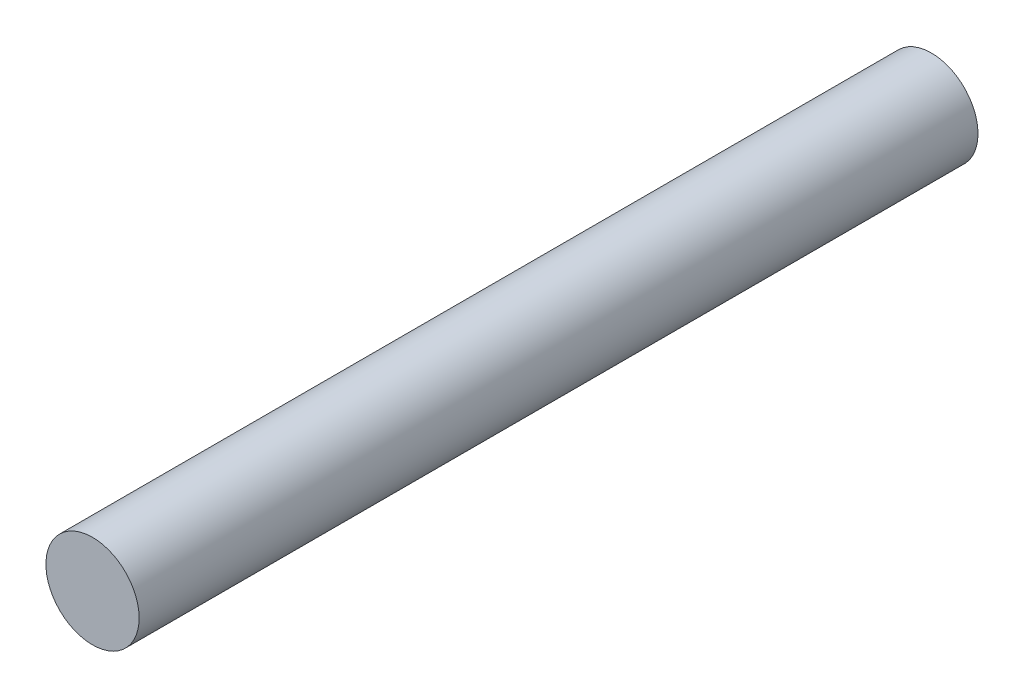
ISO-10303-21;
HEADER;
FILE_DESCRIPTION(('STEP AP214'),'2;1');
FILE_NAME('part.step','',(''),(''),'','','');
FILE_SCHEMA(('AUTOMOTIVE_DESIGN { 1 0 10303 214 1 1 1 1 }'));
ENDSEC;
DATA;
#1=APPLICATION_CONTEXT('core data for automotive mechanical design processes');
#2=APPLICATION_PROTOCOL_DEFINITION('international standard','automotive_design',2000,#1);
#3=PRODUCT_CONTEXT('',#1,'mechanical');
#4=PRODUCT('Part','Part','',(#3));
#5=PRODUCT_RELATED_PRODUCT_CATEGORY('part','',(#4));
#6=PRODUCT_DEFINITION_FORMATION('','',#4);
#7=PRODUCT_DEFINITION_CONTEXT('part definition',#1,'design');
#8=PRODUCT_DEFINITION('design','',#6,#7);
#9=PRODUCT_DEFINITION_SHAPE('','',#8);
#10=(LENGTH_UNIT() NAMED_UNIT(*) SI_UNIT(.MILLI.,.METRE.));
#11=(NAMED_UNIT(*) PLANE_ANGLE_UNIT() SI_UNIT($,.RADIAN.));
#12=(NAMED_UNIT(*) SI_UNIT($,.STERADIAN.) SOLID_ANGLE_UNIT());
#13=UNCERTAINTY_MEASURE_WITH_UNIT(LENGTH_MEASURE(1.E-05),#10,'distance_accuracy_value','');
#14=(GEOMETRIC_REPRESENTATION_CONTEXT(3) GLOBAL_UNCERTAINTY_ASSIGNED_CONTEXT((#13)) GLOBAL_UNIT_ASSIGNED_CONTEXT((#10,
#11,#12)) REPRESENTATION_CONTEXT('',''));
#15=CARTESIAN_POINT('',(0.,0.,0.));
#16=DIRECTION('',(0.,0.,1.));
#17=DIRECTION('',(1.,0.,0.));
#18=AXIS2_PLACEMENT_3D('',#15,#16,#17);
#19=CARTESIAN_POINT('',(1.526,-4.501,-9.1));
#20=DIRECTION('',(0.,0.,-1.));
#21=DIRECTION('',(-1.,0.,0.));
#22=AXIS2_PLACEMENT_3D('',#19,#20,#21);
#23=PLANE('',#22);
#24=CARTESIAN_POINT('',(1.225,-4.2,-9.1));
#25=DIRECTION('',(0.,0.,1.));
#26=DIRECTION('',(1.,0.,0.));
#27=AXIS2_PLACEMENT_3D('',#24,#25,#26);
#28=CIRCLE('',#27,0.3);
#29=CARTESIAN_POINT('',(1.525,-4.2,-9.1));
#30=VERTEX_POINT('',#29);
#31=EDGE_CURVE('E19',#30,#30,#28,.T.);
#32=ORIENTED_EDGE('',*,*,#31,.F.);
#33=EDGE_LOOP('',(#32));
#34=FACE_BOUND('',#33,.T.);
#35=ADVANCED_FACE('F15',(#34),#23,.T.);
#36=CARTESIAN_POINT('',(1.225,-4.2,-9.1));
#37=DIRECTION('',(0.,0.,1.));
#38=DIRECTION('',(1.,0.,0.));
#39=AXIS2_PLACEMENT_3D('',#36,#37,#38);
#40=CYLINDRICAL_SURFACE('',#39,0.3);
#41=CARTESIAN_POINT('',(1.225,-4.2,-3.7));
#42=DIRECTION('',(0.,0.,1.));
#43=DIRECTION('',(1.,0.,0.));
#44=AXIS2_PLACEMENT_3D('',#41,#42,#43);
#45=CIRCLE('',#44,0.3);
#46=CARTESIAN_POINT('',(1.525,-4.2,-3.7));
#47=VERTEX_POINT('',#46);
#48=EDGE_CURVE('E10',#47,#47,#45,.T.);
#49=ORIENTED_EDGE('',*,*,#48,.F.);
#50=EDGE_LOOP('',(#49));
#51=FACE_BOUND('',#50,.T.);
#52=ORIENTED_EDGE('',*,*,#31,.T.);
#53=EDGE_LOOP('',(#52));
#54=FACE_BOUND('',#53,.T.);
#55=ADVANCED_FACE('F28',(#51,#54),#40,.T.);
#56=CARTESIAN_POINT('',(1.526,-3.899,-3.7));
#57=DIRECTION('',(0.,0.,1.));
#58=DIRECTION('',(-1.,0.,0.));
#59=AXIS2_PLACEMENT_3D('',#56,#57,#58);
#60=PLANE('',#59);
#61=ORIENTED_EDGE('',*,*,#48,.T.);
#62=EDGE_LOOP('',(#61));
#63=FACE_BOUND('',#62,.T.);
#64=ADVANCED_FACE('F17',(#63),#60,.T.);
#65=CLOSED_SHELL('',(#35,#55,#64));
#66=MANIFOLD_SOLID_BREP('B1',#65);
#67=ADVANCED_BREP_SHAPE_REPRESENTATION('',(#18,#66),#14);
#68=SHAPE_DEFINITION_REPRESENTATION(#9,#67);
ENDSEC;
END-ISO-10303-21;
